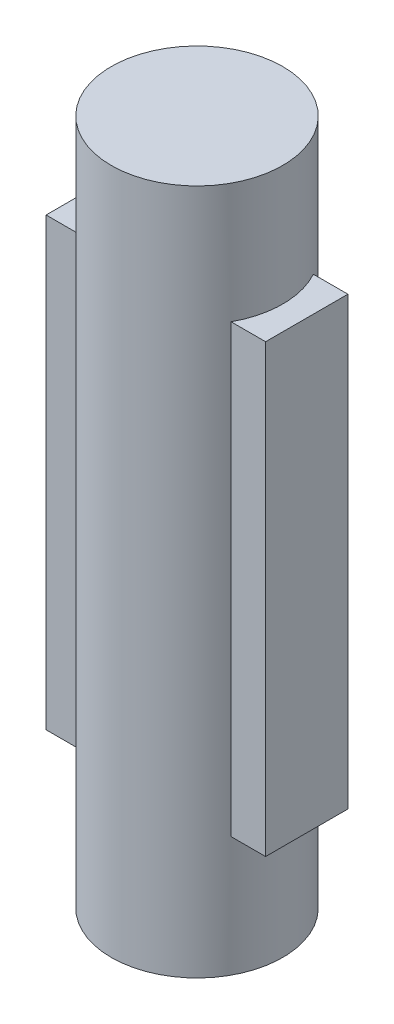
ISO-10303-21;
HEADER;
FILE_DESCRIPTION(('STEP AP214'),'2;1');
FILE_NAME('part.step','',(''),(''),'','','');
FILE_SCHEMA(('AUTOMOTIVE_DESIGN { 1 0 10303 214 1 1 1 1 }'));
ENDSEC;
DATA;
#1=APPLICATION_CONTEXT('core data for automotive mechanical design processes');
#2=APPLICATION_PROTOCOL_DEFINITION('international standard','automotive_design',2000,#1);
#3=PRODUCT_CONTEXT('',#1,'mechanical');
#4=PRODUCT('Part','Part','',(#3));
#5=PRODUCT_RELATED_PRODUCT_CATEGORY('part','',(#4));
#6=PRODUCT_DEFINITION_FORMATION('','',#4);
#7=PRODUCT_DEFINITION_CONTEXT('part definition',#1,'design');
#8=PRODUCT_DEFINITION('design','',#6,#7);
#9=PRODUCT_DEFINITION_SHAPE('','',#8);
#10=(LENGTH_UNIT() NAMED_UNIT(*) SI_UNIT(.MILLI.,.METRE.));
#11=(NAMED_UNIT(*) PLANE_ANGLE_UNIT() SI_UNIT($,.RADIAN.));
#12=(NAMED_UNIT(*) SI_UNIT($,.STERADIAN.) SOLID_ANGLE_UNIT());
#13=UNCERTAINTY_MEASURE_WITH_UNIT(LENGTH_MEASURE(1.E-05),#10,'distance_accuracy_value','');
#14=(GEOMETRIC_REPRESENTATION_CONTEXT(3) GLOBAL_UNCERTAINTY_ASSIGNED_CONTEXT((#13)) GLOBAL_UNIT_ASSIGNED_CONTEXT((#10,
#11,#12)) REPRESENTATION_CONTEXT('',''));
#15=CARTESIAN_POINT('',(0.,0.,0.));
#16=DIRECTION('',(0.,0.,1.));
#17=DIRECTION('',(1.,0.,0.));
#18=AXIS2_PLACEMENT_3D('',#15,#16,#17);
#19=CARTESIAN_POINT('',(0.,12.7,0.));
#20=DIRECTION('',(0.,-1.,0.));
#21=DIRECTION('',(0.,0.,-1.));
#22=AXIS2_PLACEMENT_3D('',#19,#20,#21);
#23=CYLINDRICAL_SURFACE('',#22,3.175);
#24=CARTESIAN_POINT('',(0.,8.255,0.));
#25=DIRECTION('',(0.,-1.,0.));
#26=DIRECTION('',(0.,0.,-1.));
#27=AXIS2_PLACEMENT_3D('',#24,#25,#26);
#28=CIRCLE('',#27,3.175);
#29=CARTESIAN_POINT('',(-2.78532744933159,8.255,1.524));
#30=VERTEX_POINT('',#29);
#31=CARTESIAN_POINT('',(-2.78532744933159,8.255,-1.524));
#32=VERTEX_POINT('',#31);
#33=EDGE_CURVE('E53',#30,#32,#28,.T.);
#34=ORIENTED_EDGE('',*,*,#33,.F.);
#35=DIRECTION('',(0.,-1.,0.));
#36=VECTOR('',#35,1.);
#37=CARTESIAN_POINT('',(-2.78532744933159,12.7,1.524));
#38=LINE('',#37,#36);
#39=CARTESIAN_POINT('',(-2.78532744933159,-8.255,1.524));
#40=VERTEX_POINT('',#39);
#41=EDGE_CURVE('E157',#40,#30,#38,.F.);
#42=ORIENTED_EDGE('',*,*,#41,.F.);
#43=CARTESIAN_POINT('',(0.,-8.255,0.));
#44=DIRECTION('',(0.,-1.,0.));
#45=DIRECTION('',(0.,0.,-1.));
#46=AXIS2_PLACEMENT_3D('',#43,#44,#45);
#47=CIRCLE('',#46,3.175);
#48=CARTESIAN_POINT('',(-2.78532744933159,-8.255,-1.524));
#49=VERTEX_POINT('',#48);
#50=EDGE_CURVE('E152',#40,#49,#47,.T.);
#51=ORIENTED_EDGE('',*,*,#50,.T.);
#52=DIRECTION('',(0.,-1.,0.));
#53=VECTOR('',#52,1.);
#54=CARTESIAN_POINT('',(-2.78532744933159,12.7,-1.524));
#55=LINE('',#54,#53);
#56=EDGE_CURVE('E161',#32,#49,#55,.T.);
#57=ORIENTED_EDGE('',*,*,#56,.F.);
#58=EDGE_LOOP('',(#34,#42,#51,#57));
#59=FACE_BOUND('',#58,.T.);
#60=CARTESIAN_POINT('',(0.,12.7,0.));
#61=DIRECTION('',(0.,1.,0.));
#62=DIRECTION('',(0.,0.,1.));
#63=AXIS2_PLACEMENT_3D('',#60,#61,#62);
#64=CIRCLE('',#63,3.175);
#65=CARTESIAN_POINT('',(0.,12.7,3.175));
#66=VERTEX_POINT('',#65);
#67=EDGE_CURVE('E143',#66,#66,#64,.T.);
#68=ORIENTED_EDGE('',*,*,#67,.F.);
#69=EDGE_LOOP('',(#68));
#70=FACE_BOUND('',#69,.T.);
#71=CARTESIAN_POINT('',(0.,-12.7,0.));
#72=DIRECTION('',(0.,1.,0.));
#73=DIRECTION('',(0.,0.,1.));
#74=AXIS2_PLACEMENT_3D('',#71,#72,#73);
#75=CIRCLE('',#74,3.175);
#76=CARTESIAN_POINT('',(0.,-12.7,3.175));
#77=VERTEX_POINT('',#76);
#78=EDGE_CURVE('E137',#77,#77,#75,.T.);
#79=ORIENTED_EDGE('',*,*,#78,.T.);
#80=EDGE_LOOP('',(#79));
#81=FACE_BOUND('',#80,.T.);
#82=CARTESIAN_POINT('',(2.78532744933159,8.255,-1.524));
#83=VERTEX_POINT('',#82);
#84=CARTESIAN_POINT('',(2.78532744933159,8.255,1.524));
#85=VERTEX_POINT('',#84);
#86=EDGE_CURVE('E11',#83,#85,#28,.T.);
#87=ORIENTED_EDGE('',*,*,#86,.F.);
#88=DIRECTION('',(0.,-1.,0.));
#89=VECTOR('',#88,1.);
#90=CARTESIAN_POINT('',(2.78532744933159,12.7,-1.524));
#91=LINE('',#90,#89);
#92=CARTESIAN_POINT('',(2.78532744933159,-8.255,-1.524));
#93=VERTEX_POINT('',#92);
#94=EDGE_CURVE('E46',#93,#83,#91,.F.);
#95=ORIENTED_EDGE('',*,*,#94,.F.);
#96=CARTESIAN_POINT('',(2.78532744933159,-8.255,1.524));
#97=VERTEX_POINT('',#96);
#98=EDGE_CURVE('E158',#93,#97,#47,.T.);
#99=ORIENTED_EDGE('',*,*,#98,.T.);
#100=DIRECTION('',(0.,-1.,0.));
#101=VECTOR('',#100,1.);
#102=CARTESIAN_POINT('',(2.78532744933159,12.7,1.524));
#103=LINE('',#102,#101);
#104=EDGE_CURVE('E164',#85,#97,#103,.T.);
#105=ORIENTED_EDGE('',*,*,#104,.F.);
#106=EDGE_LOOP('',(#87,#95,#99,#105));
#107=FACE_BOUND('',#106,.T.);
#108=ADVANCED_FACE('F43',(#59,#70,#81,#107),#23,.T.);
#109=CARTESIAN_POINT('',(0.,12.7,0.));
#110=DIRECTION('',(0.,1.,0.));
#111=DIRECTION('',(0.,0.,1.));
#112=AXIS2_PLACEMENT_3D('',#109,#110,#111);
#113=PLANE('',#112);
#114=ORIENTED_EDGE('',*,*,#67,.T.);
#115=EDGE_LOOP('',(#114));
#116=FACE_BOUND('',#115,.T.);
#117=ADVANCED_FACE('F229',(#116),#113,.T.);
#118=CARTESIAN_POINT('',(0.,-12.7,0.));
#119=DIRECTION('',(0.,1.,0.));
#120=DIRECTION('',(0.,0.,1.));
#121=AXIS2_PLACEMENT_3D('',#118,#119,#120);
#122=PLANE('',#121);
#123=ORIENTED_EDGE('',*,*,#78,.F.);
#124=EDGE_LOOP('',(#123));
#125=FACE_BOUND('',#124,.T.);
#126=ADVANCED_FACE('F233',(#125),#122,.F.);
#127=CARTESIAN_POINT('',(-4.064,8.255,1.524));
#128=DIRECTION('',(1.,0.,0.));
#129=DIRECTION('',(0.,0.,-1.));
#130=AXIS2_PLACEMENT_3D('',#127,#128,#129);
#131=PLANE('',#130);
#132=DIRECTION('',(0.,0.,1.));
#133=VECTOR('',#132,1.);
#134=CARTESIAN_POINT('',(-4.064,-8.255,1.524));
#135=LINE('',#134,#133);
#136=CARTESIAN_POINT('',(-4.064,-8.255,-1.524));
#137=VERTEX_POINT('',#136);
#138=CARTESIAN_POINT('',(-4.064,-8.255,1.524));
#139=VERTEX_POINT('',#138);
#140=EDGE_CURVE('E175',#137,#139,#135,.T.);
#141=ORIENTED_EDGE('',*,*,#140,.T.);
#142=DIRECTION('',(0.,-1.,0.));
#143=VECTOR('',#142,1.);
#144=CARTESIAN_POINT('',(-4.064,8.255,1.524));
#145=LINE('',#144,#143);
#146=CARTESIAN_POINT('',(-4.064,8.255,1.524));
#147=VERTEX_POINT('',#146);
#148=EDGE_CURVE('E146',#147,#139,#145,.T.);
#149=ORIENTED_EDGE('',*,*,#148,.F.);
#150=DIRECTION('',(0.,0.,1.));
#151=VECTOR('',#150,1.);
#152=CARTESIAN_POINT('',(-4.064,8.255,1.524));
#153=LINE('',#152,#151);
#154=CARTESIAN_POINT('',(-4.064,8.255,-1.524));
#155=VERTEX_POINT('',#154);
#156=EDGE_CURVE('E120',#155,#147,#153,.T.);
#157=ORIENTED_EDGE('',*,*,#156,.F.);
#158=DIRECTION('',(0.,-1.,0.));
#159=VECTOR('',#158,1.);
#160=CARTESIAN_POINT('',(-4.064,8.255,-1.524));
#161=LINE('',#160,#159);
#162=EDGE_CURVE('E138',#155,#137,#161,.T.);
#163=ORIENTED_EDGE('',*,*,#162,.T.);
#164=EDGE_LOOP('',(#141,#149,#157,#163));
#165=FACE_BOUND('',#164,.T.);
#166=ADVANCED_FACE('F239',(#165),#131,.F.);
#167=CARTESIAN_POINT('',(0.,8.255,0.));
#168=DIRECTION('',(0.,-1.,0.));
#169=DIRECTION('',(0.,0.,-1.));
#170=AXIS2_PLACEMENT_3D('',#167,#168,#169);
#171=PLANE('',#170);
#172=DIRECTION('',(1.,0.,0.));
#173=VECTOR('',#172,1.);
#174=CARTESIAN_POINT('',(-4.064,8.255,1.524));
#175=LINE('',#174,#173);
#176=EDGE_CURVE('E188',#147,#30,#175,.T.);
#177=ORIENTED_EDGE('',*,*,#176,.T.);
#178=ORIENTED_EDGE('',*,*,#33,.T.);
#179=DIRECTION('',(-1.,0.,0.));
#180=VECTOR('',#179,1.);
#181=CARTESIAN_POINT('',(-4.064,8.255,-1.524));
#182=LINE('',#181,#180);
#183=EDGE_CURVE('E121',#32,#155,#182,.T.);
#184=ORIENTED_EDGE('',*,*,#183,.T.);
#185=ORIENTED_EDGE('',*,*,#156,.T.);
#186=EDGE_LOOP('',(#177,#178,#184,#185));
#187=FACE_BOUND('',#186,.T.);
#188=ADVANCED_FACE('F206',(#187),#171,.F.);
#189=CARTESIAN_POINT('',(0.,-8.255,0.));
#190=DIRECTION('',(0.,-1.,0.));
#191=DIRECTION('',(0.,0.,-1.));
#192=AXIS2_PLACEMENT_3D('',#189,#190,#191);
#193=PLANE('',#192);
#194=ORIENTED_EDGE('',*,*,#50,.F.);
#195=DIRECTION('',(1.,0.,0.));
#196=VECTOR('',#195,1.);
#197=CARTESIAN_POINT('',(-4.064,-8.255,1.524));
#198=LINE('',#197,#196);
#199=EDGE_CURVE('E132',#139,#40,#198,.T.);
#200=ORIENTED_EDGE('',*,*,#199,.F.);
#201=ORIENTED_EDGE('',*,*,#140,.F.);
#202=DIRECTION('',(-1.,0.,0.));
#203=VECTOR('',#202,1.);
#204=CARTESIAN_POINT('',(-4.064,-8.255,-1.524));
#205=LINE('',#204,#203);
#206=EDGE_CURVE('E68',#49,#137,#205,.T.);
#207=ORIENTED_EDGE('',*,*,#206,.F.);
#208=EDGE_LOOP('',(#194,#200,#201,#207));
#209=FACE_BOUND('',#208,.T.);
#210=ADVANCED_FACE('F200',(#209),#193,.T.);
#211=CARTESIAN_POINT('',(-4.064,8.255,1.524));
#212=DIRECTION('',(0.,0.,-1.));
#213=DIRECTION('',(-1.,0.,0.));
#214=AXIS2_PLACEMENT_3D('',#211,#212,#213);
#215=PLANE('',#214);
#216=ORIENTED_EDGE('',*,*,#199,.T.);
#217=ORIENTED_EDGE('',*,*,#41,.T.);
#218=ORIENTED_EDGE('',*,*,#176,.F.);
#219=ORIENTED_EDGE('',*,*,#148,.T.);
#220=EDGE_LOOP('',(#216,#217,#218,#219));
#221=FACE_BOUND('',#220,.T.);
#222=ADVANCED_FACE('F195',(#221),#215,.F.);
#223=CARTESIAN_POINT('',(-4.064,8.255,-1.524));
#224=DIRECTION('',(0.,0.,1.));
#225=DIRECTION('',(1.,0.,0.));
#226=AXIS2_PLACEMENT_3D('',#223,#224,#225);
#227=PLANE('',#226);
#228=ORIENTED_EDGE('',*,*,#183,.F.);
#229=ORIENTED_EDGE('',*,*,#56,.T.);
#230=ORIENTED_EDGE('',*,*,#206,.T.);
#231=ORIENTED_EDGE('',*,*,#162,.F.);
#232=EDGE_LOOP('',(#228,#229,#230,#231));
#233=FACE_BOUND('',#232,.T.);
#234=ADVANCED_FACE('F223',(#233),#227,.F.);
#235=CARTESIAN_POINT('',(4.064,-8.255,-1.524));
#236=VERTEX_POINT('',#235);
#237=EDGE_CURVE('E173',#236,#93,#205,.T.);
#238=ORIENTED_EDGE('',*,*,#237,.T.);
#239=ORIENTED_EDGE('',*,*,#94,.T.);
#240=CARTESIAN_POINT('',(4.064,8.255,-1.524));
#241=VERTEX_POINT('',#240);
#242=EDGE_CURVE('E109',#241,#83,#182,.T.);
#243=ORIENTED_EDGE('',*,*,#242,.F.);
#244=DIRECTION('',(0.,-1.,0.));
#245=VECTOR('',#244,1.);
#246=CARTESIAN_POINT('',(4.064,8.255,-1.524));
#247=LINE('',#246,#245);
#248=EDGE_CURVE('E114',#241,#236,#247,.T.);
#249=ORIENTED_EDGE('',*,*,#248,.T.);
#250=EDGE_LOOP('',(#238,#239,#243,#249));
#251=FACE_BOUND('',#250,.T.);
#252=ADVANCED_FACE('F112',(#251),#227,.F.);
#253=CARTESIAN_POINT('',(4.064,8.255,1.524));
#254=VERTEX_POINT('',#253);
#255=EDGE_CURVE('E127',#85,#254,#175,.T.);
#256=ORIENTED_EDGE('',*,*,#255,.F.);
#257=ORIENTED_EDGE('',*,*,#104,.T.);
#258=CARTESIAN_POINT('',(4.064,-8.255,1.524));
#259=VERTEX_POINT('',#258);
#260=EDGE_CURVE('E60',#97,#259,#198,.T.);
#261=ORIENTED_EDGE('',*,*,#260,.T.);
#262=DIRECTION('',(0.,-1.,0.));
#263=VECTOR('',#262,1.);
#264=CARTESIAN_POINT('',(4.064,8.255,1.524));
#265=LINE('',#264,#263);
#266=EDGE_CURVE('E186',#254,#259,#265,.T.);
#267=ORIENTED_EDGE('',*,*,#266,.F.);
#268=EDGE_LOOP('',(#256,#257,#261,#267));
#269=FACE_BOUND('',#268,.T.);
#270=ADVANCED_FACE('F214',(#269),#215,.F.);
#271=ORIENTED_EDGE('',*,*,#242,.T.);
#272=ORIENTED_EDGE('',*,*,#86,.T.);
#273=ORIENTED_EDGE('',*,*,#255,.T.);
#274=DIRECTION('',(0.,0.,-1.));
#275=VECTOR('',#274,1.);
#276=CARTESIAN_POINT('',(4.064,8.255,1.524));
#277=LINE('',#276,#275);
#278=EDGE_CURVE('E124',#254,#241,#277,.T.);
#279=ORIENTED_EDGE('',*,*,#278,.T.);
#280=EDGE_LOOP('',(#271,#272,#273,#279));
#281=FACE_BOUND('',#280,.T.);
#282=ADVANCED_FACE('F125',(#281),#171,.F.);
#283=ORIENTED_EDGE('',*,*,#98,.F.);
#284=ORIENTED_EDGE('',*,*,#237,.F.);
#285=DIRECTION('',(0.,0.,-1.));
#286=VECTOR('',#285,1.);
#287=CARTESIAN_POINT('',(4.064,-8.255,1.524));
#288=LINE('',#287,#286);
#289=EDGE_CURVE('E135',#259,#236,#288,.T.);
#290=ORIENTED_EDGE('',*,*,#289,.F.);
#291=ORIENTED_EDGE('',*,*,#260,.F.);
#292=EDGE_LOOP('',(#283,#284,#290,#291));
#293=FACE_BOUND('',#292,.T.);
#294=ADVANCED_FACE('F172',(#293),#193,.T.);
#295=CARTESIAN_POINT('',(4.064,8.255,1.524));
#296=DIRECTION('',(-1.,0.,0.));
#297=DIRECTION('',(0.,0.,1.));
#298=AXIS2_PLACEMENT_3D('',#295,#296,#297);
#299=PLANE('',#298);
#300=ORIENTED_EDGE('',*,*,#289,.T.);
#301=ORIENTED_EDGE('',*,*,#248,.F.);
#302=ORIENTED_EDGE('',*,*,#278,.F.);
#303=ORIENTED_EDGE('',*,*,#266,.T.);
#304=EDGE_LOOP('',(#300,#301,#302,#303));
#305=FACE_BOUND('',#304,.T.);
#306=ADVANCED_FACE('F134',(#305),#299,.F.);
#307=CLOSED_SHELL('',(#108,#117,#126,#166,#188,#210,#222,#234,#252,#270,#282,#294,#306));
#308=MANIFOLD_SOLID_BREP('B2',#307);
#309=ADVANCED_BREP_SHAPE_REPRESENTATION('',(#18,#308),#14);
#310=SHAPE_DEFINITION_REPRESENTATION(#9,#309);
ENDSEC;
END-ISO-10303-21;
